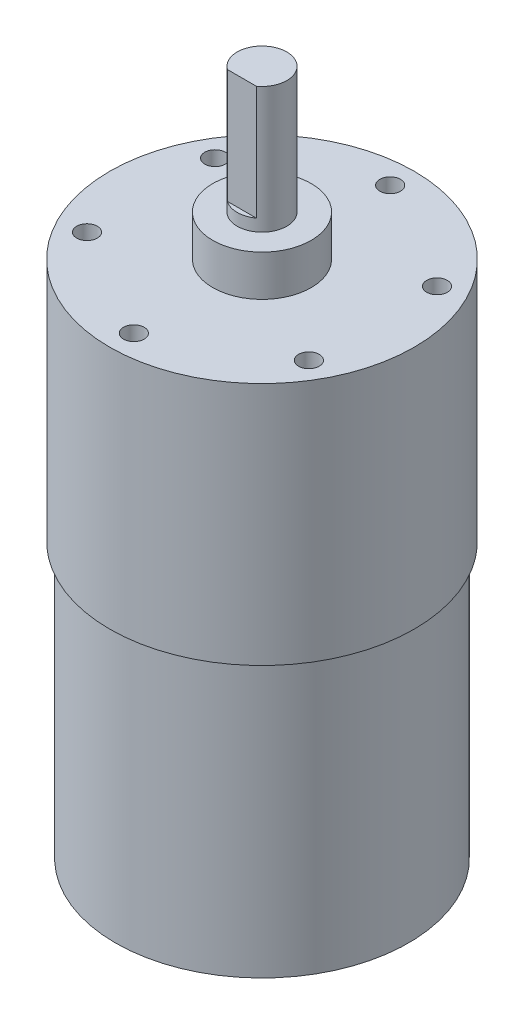
ISO-10303-21;
HEADER;
FILE_DESCRIPTION(('STEP AP214'),'2;1');
FILE_NAME('part.step','',(''),(''),'','','');
FILE_SCHEMA(('AUTOMOTIVE_DESIGN { 1 0 10303 214 1 1 1 1 }'));
ENDSEC;
DATA;
#1=APPLICATION_CONTEXT('core data for automotive mechanical design processes');
#2=APPLICATION_PROTOCOL_DEFINITION('international standard','automotive_design',2000,#1);
#3=PRODUCT_CONTEXT('',#1,'mechanical');
#4=PRODUCT('Part','Part','',(#3));
#5=PRODUCT_RELATED_PRODUCT_CATEGORY('part','',(#4));
#6=PRODUCT_DEFINITION_FORMATION('','',#4);
#7=PRODUCT_DEFINITION_CONTEXT('part definition',#1,'design');
#8=PRODUCT_DEFINITION('design','',#6,#7);
#9=PRODUCT_DEFINITION_SHAPE('','',#8);
#10=(LENGTH_UNIT() NAMED_UNIT(*) SI_UNIT(.MILLI.,.METRE.));
#11=(NAMED_UNIT(*) PLANE_ANGLE_UNIT() SI_UNIT($,.RADIAN.));
#12=(NAMED_UNIT(*) SI_UNIT($,.STERADIAN.) SOLID_ANGLE_UNIT());
#13=UNCERTAINTY_MEASURE_WITH_UNIT(LENGTH_MEASURE(1.E-05),#10,'distance_accuracy_value','');
#14=(GEOMETRIC_REPRESENTATION_CONTEXT(3) GLOBAL_UNCERTAINTY_ASSIGNED_CONTEXT((#13)) GLOBAL_UNIT_ASSIGNED_CONTEXT((#10,
#11,#12)) REPRESENTATION_CONTEXT('',''));
#15=CARTESIAN_POINT('',(0.,0.,0.));
#16=DIRECTION('',(0.,0.,1.));
#17=DIRECTION('',(1.,0.,0.));
#18=AXIS2_PLACEMENT_3D('',#15,#16,#17);
#19=CARTESIAN_POINT('',(0.,29.5402,0.));
#20=DIRECTION('',(0.,-1.,0.));
#21=DIRECTION('',(0.,0.,-1.));
#22=AXIS2_PLACEMENT_3D('',#19,#20,#21);
#23=CYLINDRICAL_SURFACE('',#22,18.4277);
#24=CARTESIAN_POINT('',(0.,29.5402,0.));
#25=DIRECTION('',(0.,1.,0.));
#26=DIRECTION('',(0.,0.,1.));
#27=AXIS2_PLACEMENT_3D('',#24,#25,#26);
#28=CIRCLE('',#27,18.4277);
#29=CARTESIAN_POINT('',(0.,29.5402,18.4277));
#30=VERTEX_POINT('',#29);
#31=EDGE_CURVE('E215',#30,#30,#28,.T.);
#32=ORIENTED_EDGE('',*,*,#31,.F.);
#33=EDGE_LOOP('',(#32));
#34=FACE_BOUND('',#33,.T.);
#35=CARTESIAN_POINT('',(0.,0.,0.));
#36=DIRECTION('',(0.,1.,0.));
#37=DIRECTION('',(0.,0.,1.));
#38=AXIS2_PLACEMENT_3D('',#35,#36,#37);
#39=CIRCLE('',#38,18.4277);
#40=CARTESIAN_POINT('',(0.,0.,18.4277));
#41=VERTEX_POINT('',#40);
#42=EDGE_CURVE('E210',#41,#41,#39,.T.);
#43=ORIENTED_EDGE('',*,*,#42,.T.);
#44=EDGE_LOOP('',(#43));
#45=FACE_BOUND('',#44,.T.);
#46=ADVANCED_FACE('F39',(#34,#45),#23,.T.);
#47=CARTESIAN_POINT('',(0.,29.5402,0.));
#48=DIRECTION('',(0.,1.,0.));
#49=DIRECTION('',(0.,0.,1.));
#50=AXIS2_PLACEMENT_3D('',#47,#48,#49);
#51=PLANE('',#50);
#52=CARTESIAN_POINT('',(0.,29.5402,-15.5));
#53=DIRECTION('',(0.,1.,0.));
#54=DIRECTION('',(0.,0.,1.));
#55=AXIS2_PLACEMENT_3D('',#52,#53,#54);
#56=CIRCLE('',#55,1.25);
#57=CARTESIAN_POINT('',(0.,29.5402,-14.25));
#58=VERTEX_POINT('',#57);
#59=EDGE_CURVE('E109',#58,#58,#56,.T.);
#60=ORIENTED_EDGE('',*,*,#59,.F.);
#61=EDGE_LOOP('',(#60));
#62=FACE_BOUND('',#61,.T.);
#63=CARTESIAN_POINT('',(13.4233937586588,29.5402,-7.74999999999997));
#64=DIRECTION('',(0.,1.,0.));
#65=DIRECTION('',(0.,0.,1.));
#66=AXIS2_PLACEMENT_3D('',#63,#64,#65);
#67=CIRCLE('',#66,1.25);
#68=CARTESIAN_POINT('',(13.4233937586588,29.5402,-6.49999999999997));
#69=VERTEX_POINT('',#68);
#70=EDGE_CURVE('E108',#69,#69,#67,.T.);
#71=ORIENTED_EDGE('',*,*,#70,.F.);
#72=EDGE_LOOP('',(#71));
#73=FACE_BOUND('',#72,.T.);
#74=CARTESIAN_POINT('',(13.4233937586591,29.5402,7.74999999999981));
#75=DIRECTION('',(0.,1.,0.));
#76=DIRECTION('',(0.,0.,1.));
#77=AXIS2_PLACEMENT_3D('',#74,#75,#76);
#78=CIRCLE('',#77,1.25);
#79=CARTESIAN_POINT('',(13.4233937586591,29.5402,8.99999999999981));
#80=VERTEX_POINT('',#79);
#81=EDGE_CURVE('E124',#80,#80,#78,.T.);
#82=ORIENTED_EDGE('',*,*,#81,.F.);
#83=EDGE_LOOP('',(#82));
#84=FACE_BOUND('',#83,.T.);
#85=CARTESIAN_POINT('',(4.36740091093905E-13,29.5402,15.5));
#86=DIRECTION('',(0.,1.,0.));
#87=DIRECTION('',(0.,0.,1.));
#88=AXIS2_PLACEMENT_3D('',#85,#86,#87);
#89=CIRCLE('',#88,1.25);
#90=CARTESIAN_POINT('',(4.36740091093905E-13,29.5402,16.75));
#91=VERTEX_POINT('',#90);
#92=EDGE_CURVE('E132',#91,#91,#89,.T.);
#93=ORIENTED_EDGE('',*,*,#92,.F.);
#94=EDGE_LOOP('',(#93));
#95=FACE_BOUND('',#94,.T.);
#96=CARTESIAN_POINT('',(-13.4233937586585,29.5402,7.7500000000002));
#97=DIRECTION('',(0.,1.,0.));
#98=DIRECTION('',(0.,0.,1.));
#99=AXIS2_PLACEMENT_3D('',#96,#97,#98);
#100=CIRCLE('',#99,1.25);
#101=CARTESIAN_POINT('',(-13.4233937586585,29.5402,9.0000000000002));
#102=VERTEX_POINT('',#101);
#103=EDGE_CURVE('E139',#102,#102,#100,.T.);
#104=ORIENTED_EDGE('',*,*,#103,.F.);
#105=EDGE_LOOP('',(#104));
#106=FACE_BOUND('',#105,.T.);
#107=CARTESIAN_POINT('',(-13.4233937586587,29.5402,-7.75000000000016));
#108=DIRECTION('',(0.,1.,0.));
#109=DIRECTION('',(0.,0.,1.));
#110=AXIS2_PLACEMENT_3D('',#107,#108,#109);
#111=CIRCLE('',#110,1.25);
#112=CARTESIAN_POINT('',(-13.4233937586587,29.5402,-6.50000000000016));
#113=VERTEX_POINT('',#112);
#114=EDGE_CURVE('E147',#113,#113,#111,.T.);
#115=ORIENTED_EDGE('',*,*,#114,.F.);
#116=EDGE_LOOP('',(#115));
#117=FACE_BOUND('',#116,.T.);
#118=CARTESIAN_POINT('',(0.,29.5402,0.));
#119=DIRECTION('',(0.,1.,0.));
#120=DIRECTION('',(0.,0.,1.));
#121=AXIS2_PLACEMENT_3D('',#118,#119,#120);
#122=CIRCLE('',#121,5.9563);
#123=CARTESIAN_POINT('',(0.,29.5402,5.9563));
#124=VERTEX_POINT('',#123);
#125=EDGE_CURVE('E205',#124,#124,#122,.T.);
#126=ORIENTED_EDGE('',*,*,#125,.F.);
#127=EDGE_LOOP('',(#126));
#128=FACE_BOUND('',#127,.T.);
#129=ORIENTED_EDGE('',*,*,#31,.T.);
#130=EDGE_LOOP('',(#129));
#131=FACE_BOUND('',#130,.T.);
#132=ADVANCED_FACE('F292',(#62,#73,#84,#95,#106,#117,#128,#131),#51,.T.);
#133=CARTESIAN_POINT('',(0.,0.,0.));
#134=DIRECTION('',(0.,1.,0.));
#135=DIRECTION('',(0.,0.,1.));
#136=AXIS2_PLACEMENT_3D('',#133,#134,#135);
#137=PLANE('',#136);
#138=CARTESIAN_POINT('',(0.,0.,0.));
#139=DIRECTION('',(0.,-1.,0.));
#140=DIRECTION('',(0.,0.,-1.));
#141=AXIS2_PLACEMENT_3D('',#138,#139,#140);
#142=CIRCLE('',#141,17.7419);
#143=CARTESIAN_POINT('',(0.,0.,-17.7419));
#144=VERTEX_POINT('',#143);
#145=EDGE_CURVE('E159',#144,#144,#142,.T.);
#146=ORIENTED_EDGE('',*,*,#145,.F.);
#147=EDGE_LOOP('',(#146));
#148=FACE_BOUND('',#147,.T.);
#149=ORIENTED_EDGE('',*,*,#42,.F.);
#150=EDGE_LOOP('',(#149));
#151=FACE_BOUND('',#150,.T.);
#152=ADVANCED_FACE('F297',(#148,#151),#137,.F.);
#153=CARTESIAN_POINT('',(0.,34.4932,0.));
#154=DIRECTION('',(0.,-1.,0.));
#155=DIRECTION('',(0.,0.,-1.));
#156=AXIS2_PLACEMENT_3D('',#153,#154,#155);
#157=CYLINDRICAL_SURFACE('',#156,5.9563);
#158=CARTESIAN_POINT('',(0.,34.4932,0.));
#159=DIRECTION('',(0.,1.,0.));
#160=DIRECTION('',(0.,0.,1.));
#161=AXIS2_PLACEMENT_3D('',#158,#159,#160);
#162=CIRCLE('',#161,5.9563);
#163=CARTESIAN_POINT('',(0.,34.4932,5.9563));
#164=VERTEX_POINT('',#163);
#165=EDGE_CURVE('E206',#164,#164,#162,.T.);
#166=ORIENTED_EDGE('',*,*,#165,.F.);
#167=EDGE_LOOP('',(#166));
#168=FACE_BOUND('',#167,.T.);
#169=ORIENTED_EDGE('',*,*,#125,.T.);
#170=EDGE_LOOP('',(#169));
#171=FACE_BOUND('',#170,.T.);
#172=ADVANCED_FACE('F304',(#168,#171),#157,.T.);
#173=CARTESIAN_POINT('',(0.,34.4932,0.));
#174=DIRECTION('',(0.,1.,0.));
#175=DIRECTION('',(0.,0.,1.));
#176=AXIS2_PLACEMENT_3D('',#173,#174,#175);
#177=PLANE('',#176);
#178=CARTESIAN_POINT('',(0.,34.4932,0.));
#179=DIRECTION('',(0.,1.,0.));
#180=DIRECTION('',(0.,0.,1.));
#181=AXIS2_PLACEMENT_3D('',#178,#179,#180);
#182=CIRCLE('',#181,3.);
#183=CARTESIAN_POINT('',(0.,34.4932,3.));
#184=VERTEX_POINT('',#183);
#185=EDGE_CURVE('E167',#184,#184,#182,.T.);
#186=ORIENTED_EDGE('',*,*,#185,.F.);
#187=EDGE_LOOP('',(#186));
#188=FACE_BOUND('',#187,.T.);
#189=ORIENTED_EDGE('',*,*,#165,.T.);
#190=EDGE_LOOP('',(#189));
#191=FACE_BOUND('',#190,.T.);
#192=ADVANCED_FACE('F243',(#188,#191),#177,.T.);
#193=CARTESIAN_POINT('',(0.,49.7586,0.));
#194=DIRECTION('',(0.,-1.,0.));
#195=DIRECTION('',(0.,0.,-1.));
#196=AXIS2_PLACEMENT_3D('',#193,#194,#195);
#197=CYLINDRICAL_SURFACE('',#196,3.);
#198=CARTESIAN_POINT('',(0.,49.7586,0.));
#199=DIRECTION('',(0.,1.,0.));
#200=DIRECTION('',(0.,0.,1.));
#201=AXIS2_PLACEMENT_3D('',#198,#199,#200);
#202=CIRCLE('',#201,3.);
#203=CARTESIAN_POINT('',(1.7515468211893,49.7586,2.43558693812839));
#204=VERTEX_POINT('',#203);
#205=CARTESIAN_POINT('',(-1.75154485643253,49.7586,2.43559279091379));
#206=VERTEX_POINT('',#205);
#207=EDGE_CURVE('E211',#204,#206,#202,.T.);
#208=ORIENTED_EDGE('',*,*,#207,.F.);
#209=CARTESIAN_POINT('',(1.75153868265841,35.941,2.43559279091379));
#210=DIRECTION('',(0.,1.,0.));
#211=VECTOR('',#210,1.);
#212=LINE('',#209,#211);
#213=CARTESIAN_POINT('',(1.75154485643253,35.941,2.43559279091379));
#214=VERTEX_POINT('',#213);
#215=EDGE_CURVE('E58',#214,#204,#212,.T.);
#216=ORIENTED_EDGE('',*,*,#215,.F.);
#217=CARTESIAN_POINT('',(-1.75154696093876,35.941,2.43559571731341));
#218=CARTESIAN_POINT('',(-0.967045387546277,35.941,2.99976625553515));
#219=CARTESIAN_POINT('',(2.5061302770437E-06,35.941,3.00000720908516));
#220=CARTESIAN_POINT('',(0.966378276965656,35.941,3.00024799516634));
#221=CARTESIAN_POINT('',(1.75155103020665,35.941,2.43559279091379));
#222=B_SPLINE_CURVE_WITH_KNOTS('',2,(#217,#218,#219,#220,#221),.UNSPECIFIED.,.F.,.F.,(3,2,3),
(0.,0.5,1.),.UNSPECIFIED.);
#223=CARTESIAN_POINT('',(-1.75154485643253,35.941,2.43559279091379));
#224=VERTEX_POINT('',#223);
#225=EDGE_CURVE('E171',#224,#214,#222,.T.);
#226=ORIENTED_EDGE('',*,*,#225,.F.);
#227=CARTESIAN_POINT('',(-1.75153868265841,35.941,2.43559279091379));
#228=DIRECTION('',(0.,1.,0.));
#229=VECTOR('',#228,1.);
#230=LINE('',#227,#229);
#231=EDGE_CURVE('E67',#224,#206,#230,.T.);
#232=ORIENTED_EDGE('',*,*,#231,.T.);
#233=EDGE_LOOP('',(#208,#216,#226,#232));
#234=FACE_BOUND('',#233,.T.);
#235=ORIENTED_EDGE('',*,*,#185,.T.);
#236=EDGE_LOOP('',(#235));
#237=FACE_BOUND('',#236,.T.);
#238=ADVANCED_FACE('F234',(#234,#237),#197,.T.);
#239=CARTESIAN_POINT('',(0.,49.7586,0.));
#240=DIRECTION('',(0.,1.,0.));
#241=DIRECTION('',(0.,0.,1.));
#242=AXIS2_PLACEMENT_3D('',#239,#240,#241);
#243=PLANE('',#242);
#244=DIRECTION('',(-1.,0.,0.));
#245=VECTOR('',#244,1.);
#246=CARTESIAN_POINT('',(-1.75155103020665,49.7586,2.43559279091379));
#247=LINE('',#246,#245);
#248=EDGE_CURVE('E163',#204,#206,#247,.T.);
#249=ORIENTED_EDGE('',*,*,#248,.F.);
#250=ORIENTED_EDGE('',*,*,#207,.T.);
#251=EDGE_LOOP('',(#249,#250));
#252=FACE_BOUND('',#251,.T.);
#253=ADVANCED_FACE('F189',(#252),#243,.T.);
#254=CARTESIAN_POINT('',(-1.75155103020665,35.941,2.43559279091379));
#255=DIRECTION('',(0.,0.,-1.));
#256=DIRECTION('',(-1.,0.,0.));
#257=AXIS2_PLACEMENT_3D('',#254,#255,#256);
#258=PLANE('',#257);
#259=ORIENTED_EDGE('',*,*,#248,.T.);
#260=ORIENTED_EDGE('',*,*,#231,.F.);
#261=DIRECTION('',(-1.,0.,0.));
#262=VECTOR('',#261,1.);
#263=CARTESIAN_POINT('',(-1.75155103020665,35.941,2.43559279091379));
#264=LINE('',#263,#262);
#265=EDGE_CURVE('E168',#214,#224,#264,.T.);
#266=ORIENTED_EDGE('',*,*,#265,.F.);
#267=ORIENTED_EDGE('',*,*,#215,.T.);
#268=EDGE_LOOP('',(#259,#260,#266,#267));
#269=FACE_BOUND('',#268,.T.);
#270=ADVANCED_FACE('F178',(#269),#258,.F.);
#271=CARTESIAN_POINT('',(0.,35.941,0.));
#272=DIRECTION('',(0.,1.,0.));
#273=DIRECTION('',(0.,0.,1.));
#274=AXIS2_PLACEMENT_3D('',#271,#272,#273);
#275=PLANE('',#274);
#276=ORIENTED_EDGE('',*,*,#225,.T.);
#277=ORIENTED_EDGE('',*,*,#265,.T.);
#278=EDGE_LOOP('',(#276,#277));
#279=FACE_BOUND('',#278,.T.);
#280=ADVANCED_FACE('F188',(#279),#275,.T.);
#281=CARTESIAN_POINT('',(0.,-33.2232,0.));
#282=DIRECTION('',(0.,1.,0.));
#283=DIRECTION('',(0.,0.,1.));
#284=AXIS2_PLACEMENT_3D('',#281,#282,#283);
#285=CYLINDRICAL_SURFACE('',#284,17.7419);
#286=CARTESIAN_POINT('',(0.,-33.2232,0.));
#287=DIRECTION('',(0.,-1.,0.));
#288=DIRECTION('',(0.,0.,-1.));
#289=AXIS2_PLACEMENT_3D('',#286,#287,#288);
#290=CIRCLE('',#289,17.7419);
#291=CARTESIAN_POINT('',(0.,-33.2232,-17.7419));
#292=VERTEX_POINT('',#291);
#293=EDGE_CURVE('E154',#292,#292,#290,.T.);
#294=ORIENTED_EDGE('',*,*,#293,.F.);
#295=EDGE_LOOP('',(#294));
#296=FACE_BOUND('',#295,.T.);
#297=ORIENTED_EDGE('',*,*,#145,.T.);
#298=EDGE_LOOP('',(#297));
#299=FACE_BOUND('',#298,.T.);
#300=ADVANCED_FACE('F338',(#296,#299),#285,.T.);
#301=CARTESIAN_POINT('',(0.,-33.2232,0.));
#302=DIRECTION('',(0.,-1.,0.));
#303=DIRECTION('',(0.,0.,-1.));
#304=AXIS2_PLACEMENT_3D('',#301,#302,#303);
#305=PLANE('',#304);
#306=CARTESIAN_POINT('',(0.,-33.2232,0.));
#307=DIRECTION('',(0.,-1.,0.));
#308=DIRECTION('',(0.,0.,-1.));
#309=AXIS2_PLACEMENT_3D('',#306,#307,#308);
#310=CIRCLE('',#309,5.0292);
#311=CARTESIAN_POINT('',(0.,-33.2232,-5.0292));
#312=VERTEX_POINT('',#311);
#313=EDGE_CURVE('E155',#312,#312,#310,.T.);
#314=ORIENTED_EDGE('',*,*,#313,.F.);
#315=EDGE_LOOP('',(#314));
#316=FACE_BOUND('',#315,.T.);
#317=ORIENTED_EDGE('',*,*,#293,.T.);
#318=EDGE_LOOP('',(#317));
#319=FACE_BOUND('',#318,.T.);
#320=ADVANCED_FACE('F346',(#316,#319),#305,.T.);
#321=CARTESIAN_POINT('',(0.,-36.2712,0.));
#322=DIRECTION('',(0.,1.,0.));
#323=DIRECTION('',(0.,0.,1.));
#324=AXIS2_PLACEMENT_3D('',#321,#322,#323);
#325=CYLINDRICAL_SURFACE('',#324,5.0292);
#326=CARTESIAN_POINT('',(0.,-34.6837,0.));
#327=DIRECTION('',(0.,-1.,0.));
#328=DIRECTION('',(0.,0.,-1.));
#329=AXIS2_PLACEMENT_3D('',#326,#327,#328);
#330=CIRCLE('',#329,5.0292);
#331=CARTESIAN_POINT('',(0.,-34.6837,-5.0292));
#332=VERTEX_POINT('',#331);
#333=EDGE_CURVE('E11',#332,#332,#330,.F.);
#334=ORIENTED_EDGE('',*,*,#333,.T.);
#335=EDGE_LOOP('',(#334));
#336=FACE_BOUND('',#335,.T.);
#337=ORIENTED_EDGE('',*,*,#313,.T.);
#338=EDGE_LOOP('',(#337));
#339=FACE_BOUND('',#338,.T.);
#340=ADVANCED_FACE('F288',(#336,#339),#325,.T.);
#341=CARTESIAN_POINT('',(0.,-36.2712,0.));
#342=DIRECTION('',(0.,-1.,0.));
#343=DIRECTION('',(0.,0.,-1.));
#344=AXIS2_PLACEMENT_3D('',#341,#342,#343);
#345=PLANE('',#344);
#346=CARTESIAN_POINT('',(0.,-36.2712,0.));
#347=DIRECTION('',(0.,-1.,0.));
#348=DIRECTION('',(0.,0.,-1.));
#349=AXIS2_PLACEMENT_3D('',#346,#347,#348);
#350=CIRCLE('',#349,3.44170000000001);
#351=CARTESIAN_POINT('',(0.,-36.2712,-3.44170000000001));
#352=VERTEX_POINT('',#351);
#353=EDGE_CURVE('E48',#352,#352,#350,.T.);
#354=ORIENTED_EDGE('',*,*,#353,.T.);
#355=EDGE_LOOP('',(#354));
#356=FACE_BOUND('',#355,.T.);
#357=ADVANCED_FACE('F276',(#356),#345,.T.);
#358=CARTESIAN_POINT('',(0.,-36.2712,0.));
#359=DIRECTION('',(0.,1.,0.));
#360=DIRECTION('',(0.,0.,1.));
#361=AXIS2_PLACEMENT_3D('',#358,#359,#360);
#362=CONICAL_SURFACE('',#361,3.44170000000001,0.785398163397443);
#363=ORIENTED_EDGE('',*,*,#333,.F.);
#364=EDGE_LOOP('',(#363));
#365=FACE_BOUND('',#364,.T.);
#366=ORIENTED_EDGE('',*,*,#353,.F.);
#367=EDGE_LOOP('',(#366));
#368=FACE_BOUND('',#367,.T.);
#369=ADVANCED_FACE('F41',(#365,#368),#362,.T.);
#370=CARTESIAN_POINT('',(-13.4233937586587,24.4602,-7.75000000000016));
#371=DIRECTION('',(0.,1.,0.));
#372=DIRECTION('',(0.,0.,1.));
#373=AXIS2_PLACEMENT_3D('',#370,#371,#372);
#374=CONICAL_SURFACE('',#373,1.25,1.02974425867665);
#375=CARTESIAN_POINT('',(-13.4233937586587,23.7091242262155,-7.75000000000016));
#376=VERTEX_POINT('',#375);
#377=VERTEX_LOOP('',#376);
#378=FACE_BOUND('',#377,.T.);
#379=CARTESIAN_POINT('',(-13.4233937586587,24.4602,-7.75000000000016));
#380=DIRECTION('',(0.,1.,0.));
#381=DIRECTION('',(0.,0.,1.));
#382=AXIS2_PLACEMENT_3D('',#379,#380,#381);
#383=CIRCLE('',#382,1.25);
#384=CARTESIAN_POINT('',(-13.4233937586587,24.4602,-6.50000000000016));
#385=VERTEX_POINT('',#384);
#386=EDGE_CURVE('E150',#385,#385,#383,.T.);
#387=ORIENTED_EDGE('',*,*,#386,.T.);
#388=EDGE_LOOP('',(#387));
#389=FACE_BOUND('',#388,.T.);
#390=ADVANCED_FACE('F279',(#378,#389),#374,.F.);
#391=CARTESIAN_POINT('',(-13.4233937586587,29.5402,-7.75000000000016));
#392=DIRECTION('',(0.,1.,0.));
#393=DIRECTION('',(0.,0.,1.));
#394=AXIS2_PLACEMENT_3D('',#391,#392,#393);
#395=CYLINDRICAL_SURFACE('',#394,1.25);
#396=ORIENTED_EDGE('',*,*,#386,.F.);
#397=EDGE_LOOP('',(#396));
#398=FACE_BOUND('',#397,.T.);
#399=ORIENTED_EDGE('',*,*,#114,.T.);
#400=EDGE_LOOP('',(#399));
#401=FACE_BOUND('',#400,.T.);
#402=ADVANCED_FACE('F285',(#398,#401),#395,.F.);
#403=CARTESIAN_POINT('',(-13.4233937586585,24.4602,7.7500000000002));
#404=DIRECTION('',(0.,1.,0.));
#405=DIRECTION('',(0.,0.,1.));
#406=AXIS2_PLACEMENT_3D('',#403,#404,#405);
#407=CONICAL_SURFACE('',#406,1.25,1.02974425867665);
#408=CARTESIAN_POINT('',(-13.4233937586585,23.7091242262155,7.7500000000002));
#409=VERTEX_POINT('',#408);
#410=VERTEX_LOOP('',#409);
#411=FACE_BOUND('',#410,.T.);
#412=CARTESIAN_POINT('',(-13.4233937586585,24.4602,7.7500000000002));
#413=DIRECTION('',(0.,1.,0.));
#414=DIRECTION('',(0.,0.,1.));
#415=AXIS2_PLACEMENT_3D('',#412,#413,#414);
#416=CIRCLE('',#415,1.25);
#417=CARTESIAN_POINT('',(-13.4233937586585,24.4602,9.0000000000002));
#418=VERTEX_POINT('',#417);
#419=EDGE_CURVE('E143',#418,#418,#416,.T.);
#420=ORIENTED_EDGE('',*,*,#419,.T.);
#421=EDGE_LOOP('',(#420));
#422=FACE_BOUND('',#421,.T.);
#423=ADVANCED_FACE('F374',(#411,#422),#407,.F.);
#424=CARTESIAN_POINT('',(-13.4233937586585,29.5402,7.7500000000002));
#425=DIRECTION('',(0.,1.,0.));
#426=DIRECTION('',(0.,0.,1.));
#427=AXIS2_PLACEMENT_3D('',#424,#425,#426);
#428=CYLINDRICAL_SURFACE('',#427,1.25);
#429=ORIENTED_EDGE('',*,*,#419,.F.);
#430=EDGE_LOOP('',(#429));
#431=FACE_BOUND('',#430,.T.);
#432=ORIENTED_EDGE('',*,*,#103,.T.);
#433=EDGE_LOOP('',(#432));
#434=FACE_BOUND('',#433,.T.);
#435=ADVANCED_FACE('F369',(#431,#434),#428,.F.);
#436=CARTESIAN_POINT('',(4.36740091093905E-13,24.4602,15.5));
#437=DIRECTION('',(0.,1.,0.));
#438=DIRECTION('',(0.,0.,1.));
#439=AXIS2_PLACEMENT_3D('',#436,#437,#438);
#440=CONICAL_SURFACE('',#439,1.25,1.02974425867665);
#441=CARTESIAN_POINT('',(4.35228171697366E-13,23.7091242262155,15.5));
#442=VERTEX_POINT('',#441);
#443=VERTEX_LOOP('',#442);
#444=FACE_BOUND('',#443,.T.);
#445=CARTESIAN_POINT('',(4.36740091093905E-13,24.4602,15.5));
#446=DIRECTION('',(0.,1.,0.));
#447=DIRECTION('',(0.,0.,1.));
#448=AXIS2_PLACEMENT_3D('',#445,#446,#447);
#449=CIRCLE('',#448,1.25);
#450=CARTESIAN_POINT('',(4.36740091093905E-13,24.4602,16.75));
#451=VERTEX_POINT('',#450);
#452=EDGE_CURVE('E136',#451,#451,#449,.T.);
#453=ORIENTED_EDGE('',*,*,#452,.T.);
#454=EDGE_LOOP('',(#453));
#455=FACE_BOUND('',#454,.T.);
#456=ADVANCED_FACE('F373',(#444,#455),#440,.F.);
#457=CARTESIAN_POINT('',(4.36740091093905E-13,29.5402,15.5));
#458=DIRECTION('',(0.,1.,0.));
#459=DIRECTION('',(0.,0.,1.));
#460=AXIS2_PLACEMENT_3D('',#457,#458,#459);
#461=CYLINDRICAL_SURFACE('',#460,1.25);
#462=ORIENTED_EDGE('',*,*,#452,.F.);
#463=EDGE_LOOP('',(#462));
#464=FACE_BOUND('',#463,.T.);
#465=ORIENTED_EDGE('',*,*,#92,.T.);
#466=EDGE_LOOP('',(#465));
#467=FACE_BOUND('',#466,.T.);
#468=ADVANCED_FACE('F472',(#464,#467),#461,.F.);
#469=CARTESIAN_POINT('',(13.4233937586591,24.4602,7.74999999999981));
#470=DIRECTION('',(0.,1.,0.));
#471=DIRECTION('',(0.,0.,1.));
#472=AXIS2_PLACEMENT_3D('',#469,#470,#471);
#473=CONICAL_SURFACE('',#472,1.25,1.02974425867665);
#474=CARTESIAN_POINT('',(13.4233937586591,23.7091242262155,7.74999999999981));
#475=VERTEX_POINT('',#474);
#476=VERTEX_LOOP('',#475);
#477=FACE_BOUND('',#476,.T.);
#478=CARTESIAN_POINT('',(13.4233937586591,24.4602,7.74999999999981));
#479=DIRECTION('',(0.,1.,0.));
#480=DIRECTION('',(0.,0.,1.));
#481=AXIS2_PLACEMENT_3D('',#478,#479,#480);
#482=CIRCLE('',#481,1.25);
#483=CARTESIAN_POINT('',(13.4233937586591,24.4602,8.99999999999981));
#484=VERTEX_POINT('',#483);
#485=EDGE_CURVE('E128',#484,#484,#482,.T.);
#486=ORIENTED_EDGE('',*,*,#485,.T.);
#487=EDGE_LOOP('',(#486));
#488=FACE_BOUND('',#487,.T.);
#489=ADVANCED_FACE('F481',(#477,#488),#473,.F.);
#490=CARTESIAN_POINT('',(13.4233937586591,29.5402,7.74999999999981));
#491=DIRECTION('',(0.,1.,0.));
#492=DIRECTION('',(0.,0.,1.));
#493=AXIS2_PLACEMENT_3D('',#490,#491,#492);
#494=CYLINDRICAL_SURFACE('',#493,1.25);
#495=ORIENTED_EDGE('',*,*,#485,.F.);
#496=EDGE_LOOP('',(#495));
#497=FACE_BOUND('',#496,.T.);
#498=ORIENTED_EDGE('',*,*,#81,.T.);
#499=EDGE_LOOP('',(#498));
#500=FACE_BOUND('',#499,.T.);
#501=ADVANCED_FACE('F490',(#497,#500),#494,.F.);
#502=CARTESIAN_POINT('',(13.4233937586588,24.4602,-7.74999999999997));
#503=DIRECTION('',(0.,1.,0.));
#504=DIRECTION('',(0.,0.,1.));
#505=AXIS2_PLACEMENT_3D('',#502,#503,#504);
#506=CONICAL_SURFACE('',#505,1.25,1.02974425867665);
#507=CARTESIAN_POINT('',(13.4233937586588,23.7091242262155,-7.74999999999997));
#508=VERTEX_POINT('',#507);
#509=VERTEX_LOOP('',#508);
#510=FACE_BOUND('',#509,.T.);
#511=CARTESIAN_POINT('',(13.4233937586588,24.4602,-7.74999999999997));
#512=DIRECTION('',(0.,1.,0.));
#513=DIRECTION('',(0.,0.,1.));
#514=AXIS2_PLACEMENT_3D('',#511,#512,#513);
#515=CIRCLE('',#514,1.25);
#516=CARTESIAN_POINT('',(13.4233937586588,24.4602,-6.49999999999997));
#517=VERTEX_POINT('',#516);
#518=EDGE_CURVE('E115',#517,#517,#515,.T.);
#519=ORIENTED_EDGE('',*,*,#518,.T.);
#520=EDGE_LOOP('',(#519));
#521=FACE_BOUND('',#520,.T.);
#522=ADVANCED_FACE('F387',(#510,#521),#506,.F.);
#523=CARTESIAN_POINT('',(13.4233937586588,29.5402,-7.74999999999997));
#524=DIRECTION('',(0.,1.,0.));
#525=DIRECTION('',(0.,0.,1.));
#526=AXIS2_PLACEMENT_3D('',#523,#524,#525);
#527=CYLINDRICAL_SURFACE('',#526,1.25);
#528=ORIENTED_EDGE('',*,*,#518,.F.);
#529=EDGE_LOOP('',(#528));
#530=FACE_BOUND('',#529,.T.);
#531=ORIENTED_EDGE('',*,*,#70,.T.);
#532=EDGE_LOOP('',(#531));
#533=FACE_BOUND('',#532,.T.);
#534=ADVANCED_FACE('F101',(#530,#533),#527,.F.);
#535=CARTESIAN_POINT('',(0.,24.4602,-15.5));
#536=DIRECTION('',(0.,1.,0.));
#537=DIRECTION('',(0.,0.,1.));
#538=AXIS2_PLACEMENT_3D('',#535,#536,#537);
#539=CONICAL_SURFACE('',#538,1.25,1.02974425867665);
#540=CARTESIAN_POINT('',(0.,23.7091242262155,-15.5));
#541=VERTEX_POINT('',#540);
#542=VERTEX_LOOP('',#541);
#543=FACE_BOUND('',#542,.T.);
#544=CARTESIAN_POINT('',(0.,24.4602,-15.5));
#545=DIRECTION('',(0.,1.,0.));
#546=DIRECTION('',(0.,0.,1.));
#547=AXIS2_PLACEMENT_3D('',#544,#545,#546);
#548=CIRCLE('',#547,1.25);
#549=CARTESIAN_POINT('',(0.,24.4602,-14.25));
#550=VERTEX_POINT('',#549);
#551=EDGE_CURVE('E105',#550,#550,#548,.T.);
#552=ORIENTED_EDGE('',*,*,#551,.T.);
#553=EDGE_LOOP('',(#552));
#554=FACE_BOUND('',#553,.T.);
#555=ADVANCED_FACE('F97',(#543,#554),#539,.F.);
#556=CARTESIAN_POINT('',(0.,29.5402,-15.5));
#557=DIRECTION('',(0.,1.,0.));
#558=DIRECTION('',(0.,0.,1.));
#559=AXIS2_PLACEMENT_3D('',#556,#557,#558);
#560=CYLINDRICAL_SURFACE('',#559,1.25);
#561=ORIENTED_EDGE('',*,*,#551,.F.);
#562=EDGE_LOOP('',(#561));
#563=FACE_BOUND('',#562,.T.);
#564=ORIENTED_EDGE('',*,*,#59,.T.);
#565=EDGE_LOOP('',(#564));
#566=FACE_BOUND('',#565,.T.);
#567=ADVANCED_FACE('F100',(#563,#566),#560,.F.);
#568=CLOSED_SHELL('',(#46,#132,#152,#172,#192,#238,#253,#270,#280,#300,#320,#340,#357,#369,#390,
#402,#423,#435,#456,#468,#489,#501,#522,#534,#555,#567));
#569=MANIFOLD_SOLID_BREP('B2',#568);
#570=ADVANCED_BREP_SHAPE_REPRESENTATION('',(#18,#569),#14);
#571=SHAPE_DEFINITION_REPRESENTATION(#9,#570);
ENDSEC;
END-ISO-10303-21;
